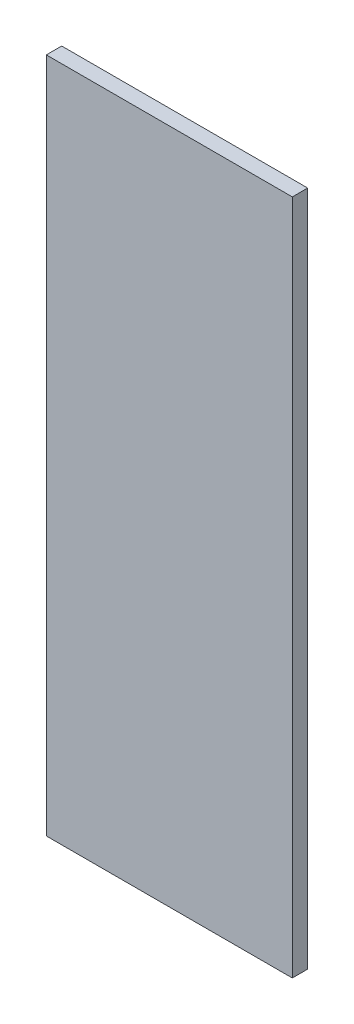
ISO-10303-21;
HEADER;
FILE_DESCRIPTION(('STEP AP214'),'2;1');
FILE_NAME('part.step','',(''),(''),'','','');
FILE_SCHEMA(('AUTOMOTIVE_DESIGN { 1 0 10303 214 1 1 1 1 }'));
ENDSEC;
DATA;
#1=APPLICATION_CONTEXT('core data for automotive mechanical design processes');
#2=APPLICATION_PROTOCOL_DEFINITION('international standard','automotive_design',2000,#1);
#3=PRODUCT_CONTEXT('',#1,'mechanical');
#4=PRODUCT('Part','Part','',(#3));
#5=PRODUCT_RELATED_PRODUCT_CATEGORY('part','',(#4));
#6=PRODUCT_DEFINITION_FORMATION('','',#4);
#7=PRODUCT_DEFINITION_CONTEXT('part definition',#1,'design');
#8=PRODUCT_DEFINITION('design','',#6,#7);
#9=PRODUCT_DEFINITION_SHAPE('','',#8);
#10=(LENGTH_UNIT() NAMED_UNIT(*) SI_UNIT(.MILLI.,.METRE.));
#11=(NAMED_UNIT(*) PLANE_ANGLE_UNIT() SI_UNIT($,.RADIAN.));
#12=(NAMED_UNIT(*) SI_UNIT($,.STERADIAN.) SOLID_ANGLE_UNIT());
#13=UNCERTAINTY_MEASURE_WITH_UNIT(LENGTH_MEASURE(1.E-05),#10,'distance_accuracy_value','');
#14=(GEOMETRIC_REPRESENTATION_CONTEXT(3) GLOBAL_UNCERTAINTY_ASSIGNED_CONTEXT((#13)) GLOBAL_UNIT_ASSIGNED_CONTEXT((#10,
#11,#12)) REPRESENTATION_CONTEXT('',''));
#15=CARTESIAN_POINT('',(0.,0.,0.));
#16=DIRECTION('',(0.,0.,1.));
#17=DIRECTION('',(1.,0.,0.));
#18=AXIS2_PLACEMENT_3D('',#15,#16,#17);
#19=CARTESIAN_POINT('',(0.,0.,3.175));
#20=DIRECTION('',(1.,0.,0.));
#21=DIRECTION('',(0.,0.,-1.));
#22=AXIS2_PLACEMENT_3D('',#19,#20,#21);
#23=PLANE('',#22);
#24=DIRECTION('',(0.,-1.,0.));
#25=VECTOR('',#24,1.);
#26=CARTESIAN_POINT('',(0.,0.,0.));
#27=LINE('',#26,#25);
#28=CARTESIAN_POINT('',(0.,139.7,0.));
#29=VERTEX_POINT('',#28);
#30=CARTESIAN_POINT('',(0.,0.,0.));
#31=VERTEX_POINT('',#30);
#32=EDGE_CURVE('E96',#29,#31,#27,.T.);
#33=ORIENTED_EDGE('',*,*,#32,.T.);
#34=DIRECTION('',(0.,0.,-1.));
#35=VECTOR('',#34,1.);
#36=CARTESIAN_POINT('',(0.,0.,3.175));
#37=LINE('',#36,#35);
#38=CARTESIAN_POINT('',(0.,0.,3.175));
#39=VERTEX_POINT('',#38);
#40=EDGE_CURVE('E11',#39,#31,#37,.T.);
#41=ORIENTED_EDGE('',*,*,#40,.F.);
#42=DIRECTION('',(0.,-1.,0.));
#43=VECTOR('',#42,1.);
#44=CARTESIAN_POINT('',(0.,0.,3.175));
#45=LINE('',#44,#43);
#46=CARTESIAN_POINT('',(0.,139.7,3.175));
#47=VERTEX_POINT('',#46);
#48=EDGE_CURVE('E84',#47,#39,#45,.T.);
#49=ORIENTED_EDGE('',*,*,#48,.F.);
#50=DIRECTION('',(0.,0.,-1.));
#51=VECTOR('',#50,1.);
#52=CARTESIAN_POINT('',(0.,139.7,3.175));
#53=LINE('',#52,#51);
#54=EDGE_CURVE('E92',#47,#29,#53,.T.);
#55=ORIENTED_EDGE('',*,*,#54,.T.);
#56=EDGE_LOOP('',(#33,#41,#49,#55));
#57=FACE_BOUND('',#56,.T.);
#58=ADVANCED_FACE('F33',(#57),#23,.F.);
#59=CARTESIAN_POINT('',(0.,0.,3.175));
#60=DIRECTION('',(0.,1.,0.));
#61=DIRECTION('',(0.,0.,1.));
#62=AXIS2_PLACEMENT_3D('',#59,#60,#61);
#63=PLANE('',#62);
#64=DIRECTION('',(1.,0.,0.));
#65=VECTOR('',#64,1.);
#66=CARTESIAN_POINT('',(0.,0.,0.));
#67=LINE('',#66,#65);
#68=CARTESIAN_POINT('',(50.8,0.,0.));
#69=VERTEX_POINT('',#68);
#70=EDGE_CURVE('E88',#31,#69,#67,.T.);
#71=ORIENTED_EDGE('',*,*,#70,.T.);
#72=DIRECTION('',(0.,0.,-1.));
#73=VECTOR('',#72,1.);
#74=CARTESIAN_POINT('',(50.8,0.,3.175));
#75=LINE('',#74,#73);
#76=CARTESIAN_POINT('',(50.8,0.,3.175));
#77=VERTEX_POINT('',#76);
#78=EDGE_CURVE('E41',#77,#69,#75,.T.);
#79=ORIENTED_EDGE('',*,*,#78,.F.);
#80=DIRECTION('',(1.,0.,0.));
#81=VECTOR('',#80,1.);
#82=CARTESIAN_POINT('',(0.,0.,3.175));
#83=LINE('',#82,#81);
#84=EDGE_CURVE('E79',#39,#77,#83,.T.);
#85=ORIENTED_EDGE('',*,*,#84,.F.);
#86=ORIENTED_EDGE('',*,*,#40,.T.);
#87=EDGE_LOOP('',(#71,#79,#85,#86));
#88=FACE_BOUND('',#87,.T.);
#89=ADVANCED_FACE('F87',(#88),#63,.F.);
#90=CARTESIAN_POINT('',(50.8,0.,3.175));
#91=DIRECTION('',(-1.,0.,0.));
#92=DIRECTION('',(0.,0.,1.));
#93=AXIS2_PLACEMENT_3D('',#90,#91,#92);
#94=PLANE('',#93);
#95=DIRECTION('',(0.,1.,0.));
#96=VECTOR('',#95,1.);
#97=CARTESIAN_POINT('',(50.8,0.,0.));
#98=LINE('',#97,#96);
#99=CARTESIAN_POINT('',(50.8,139.7,0.));
#100=VERTEX_POINT('',#99);
#101=EDGE_CURVE('E66',#69,#100,#98,.T.);
#102=ORIENTED_EDGE('',*,*,#101,.T.);
#103=DIRECTION('',(0.,0.,-1.));
#104=VECTOR('',#103,1.);
#105=CARTESIAN_POINT('',(50.8,139.7,3.175));
#106=LINE('',#105,#104);
#107=CARTESIAN_POINT('',(50.8,139.7,3.175));
#108=VERTEX_POINT('',#107);
#109=EDGE_CURVE('E89',#108,#100,#106,.T.);
#110=ORIENTED_EDGE('',*,*,#109,.F.);
#111=DIRECTION('',(0.,1.,0.));
#112=VECTOR('',#111,1.);
#113=CARTESIAN_POINT('',(50.8,0.,3.175));
#114=LINE('',#113,#112);
#115=EDGE_CURVE('E82',#77,#108,#114,.T.);
#116=ORIENTED_EDGE('',*,*,#115,.F.);
#117=ORIENTED_EDGE('',*,*,#78,.T.);
#118=EDGE_LOOP('',(#102,#110,#116,#117));
#119=FACE_BOUND('',#118,.T.);
#120=ADVANCED_FACE('F90',(#119),#94,.F.);
#121=CARTESIAN_POINT('',(0.,139.7,3.175));
#122=DIRECTION('',(0.,-1.,0.));
#123=DIRECTION('',(0.,0.,-1.));
#124=AXIS2_PLACEMENT_3D('',#121,#122,#123);
#125=PLANE('',#124);
#126=DIRECTION('',(-1.,0.,0.));
#127=VECTOR('',#126,1.);
#128=CARTESIAN_POINT('',(0.,139.7,0.));
#129=LINE('',#128,#127);
#130=EDGE_CURVE('E72',#100,#29,#129,.T.);
#131=ORIENTED_EDGE('',*,*,#130,.T.);
#132=ORIENTED_EDGE('',*,*,#54,.F.);
#133=DIRECTION('',(-1.,0.,0.));
#134=VECTOR('',#133,1.);
#135=CARTESIAN_POINT('',(0.,139.7,3.175));
#136=LINE('',#135,#134);
#137=EDGE_CURVE('E49',#108,#47,#136,.T.);
#138=ORIENTED_EDGE('',*,*,#137,.F.);
#139=ORIENTED_EDGE('',*,*,#109,.T.);
#140=EDGE_LOOP('',(#131,#132,#138,#139));
#141=FACE_BOUND('',#140,.T.);
#142=ADVANCED_FACE('F103',(#141),#125,.F.);
#143=CARTESIAN_POINT('',(0.,0.,3.175));
#144=DIRECTION('',(0.,0.,-1.));
#145=DIRECTION('',(-1.,0.,0.));
#146=AXIS2_PLACEMENT_3D('',#143,#144,#145);
#147=PLANE('',#146);
#148=ORIENTED_EDGE('',*,*,#48,.T.);
#149=ORIENTED_EDGE('',*,*,#84,.T.);
#150=ORIENTED_EDGE('',*,*,#115,.T.);
#151=ORIENTED_EDGE('',*,*,#137,.T.);
#152=EDGE_LOOP('',(#148,#149,#150,#151));
#153=FACE_BOUND('',#152,.T.);
#154=ADVANCED_FACE('F80',(#153),#147,.F.);
#155=CARTESIAN_POINT('',(0.,0.,0.));
#156=DIRECTION('',(0.,0.,-1.));
#157=DIRECTION('',(-1.,0.,0.));
#158=AXIS2_PLACEMENT_3D('',#155,#156,#157);
#159=PLANE('',#158);
#160=ORIENTED_EDGE('',*,*,#32,.F.);
#161=ORIENTED_EDGE('',*,*,#130,.F.);
#162=ORIENTED_EDGE('',*,*,#101,.F.);
#163=ORIENTED_EDGE('',*,*,#70,.F.);
#164=EDGE_LOOP('',(#160,#161,#162,#163));
#165=FACE_BOUND('',#164,.T.);
#166=ADVANCED_FACE('F106',(#165),#159,.T.);
#167=CLOSED_SHELL('',(#58,#89,#120,#142,#154,#166));
#168=MANIFOLD_SOLID_BREP('B2',#167);
#169=ADVANCED_BREP_SHAPE_REPRESENTATION('',(#18,#168),#14);
#170=SHAPE_DEFINITION_REPRESENTATION(#9,#169);
ENDSEC;
END-ISO-10303-21;
